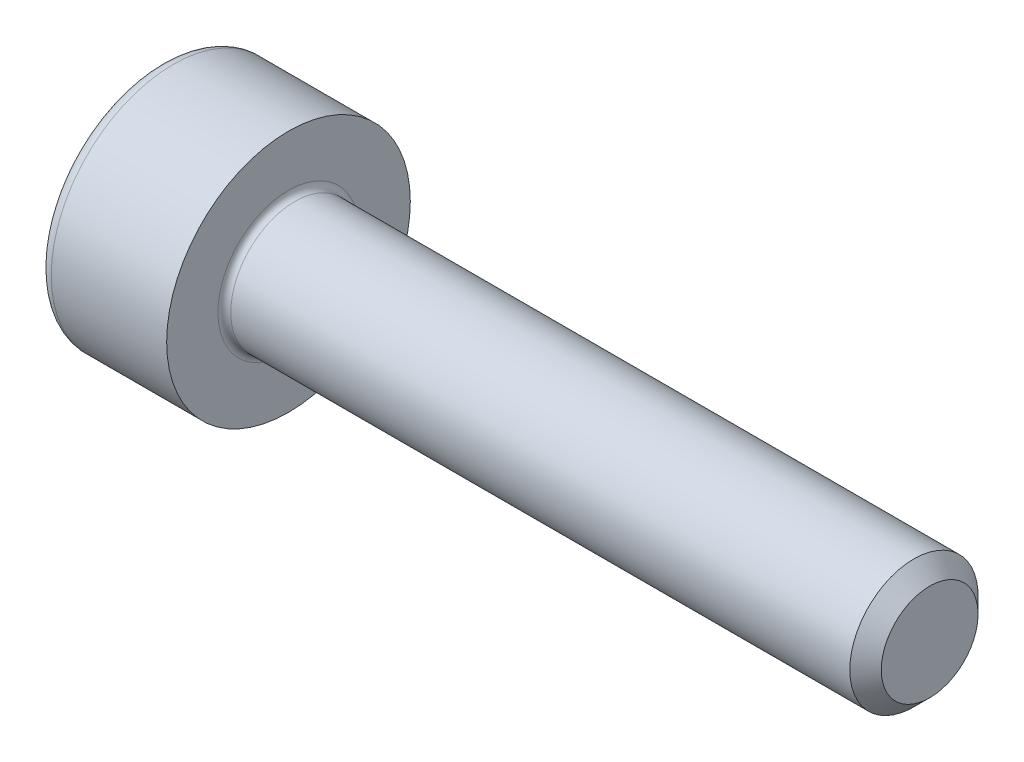
ISO-10303-21;
HEADER;
FILE_DESCRIPTION(('STEP AP214'),'2;1');
FILE_NAME('part.step','',(''),(''),'','','');
FILE_SCHEMA(('AUTOMOTIVE_DESIGN { 1 0 10303 214 1 1 1 1 }'));
ENDSEC;
DATA;
#1=APPLICATION_CONTEXT('core data for automotive mechanical design processes');
#2=APPLICATION_PROTOCOL_DEFINITION('international standard','automotive_design',2000,#1);
#3=PRODUCT_CONTEXT('',#1,'mechanical');
#4=PRODUCT('Part','Part','',(#3));
#5=PRODUCT_RELATED_PRODUCT_CATEGORY('part','',(#4));
#6=PRODUCT_DEFINITION_FORMATION('','',#4);
#7=PRODUCT_DEFINITION_CONTEXT('part definition',#1,'design');
#8=PRODUCT_DEFINITION('design','',#6,#7);
#9=PRODUCT_DEFINITION_SHAPE('','',#8);
#10=(LENGTH_UNIT() NAMED_UNIT(*) SI_UNIT(.MILLI.,.METRE.));
#11=(NAMED_UNIT(*) PLANE_ANGLE_UNIT() SI_UNIT($,.RADIAN.));
#12=(NAMED_UNIT(*) SI_UNIT($,.STERADIAN.) SOLID_ANGLE_UNIT());
#13=UNCERTAINTY_MEASURE_WITH_UNIT(LENGTH_MEASURE(1.E-05),#10,'distance_accuracy_value','');
#14=(GEOMETRIC_REPRESENTATION_CONTEXT(3) GLOBAL_UNCERTAINTY_ASSIGNED_CONTEXT((#13)) GLOBAL_UNIT_ASSIGNED_CONTEXT((#10,
#11,#12)) REPRESENTATION_CONTEXT('',''));
#15=CARTESIAN_POINT('',(0.,0.,0.));
#16=DIRECTION('',(0.,0.,1.));
#17=DIRECTION('',(1.,0.,0.));
#18=AXIS2_PLACEMENT_3D('',#15,#16,#17);
#19=CARTESIAN_POINT('',(-1.00299999991194,0.,0.));
#20=DIRECTION('',(-1.,0.,0.));
#21=DIRECTION('',(0.,0.,1.));
#22=AXIS2_PLACEMENT_3D('',#19,#20,#21);
#23=CONICAL_SURFACE('',#22,0.87122155605357,1.04719755097502);
#24=CARTESIAN_POINT('',(-0.499999999931333,-1.13686837721616E-10,0.));
#25=VERTEX_POINT('',#24);
#26=VERTEX_LOOP('',#25);
#27=FACE_BOUND('',#26,.T.);
#28=CARTESIAN_POINT('',(-0.999999999999139,0.750000000000001,0.433012701892466));
#29=CARTESIAN_POINT('',(-0.989010828274123,0.750000000000001,0.394956130482365));
#30=CARTESIAN_POINT('',(-0.979016752655061,0.750000000000001,0.356571055064928));
#31=CARTESIAN_POINT('',(-0.961572394475009,0.750000000000001,0.279136292172625));
#32=CARTESIAN_POINT('',(-0.954128282395011,0.750000000000001,0.240085229279367));
#33=CARTESIAN_POINT('',(-0.942540984774368,0.750000000000001,0.162467043896136));
#34=CARTESIAN_POINT('',(-0.938320670368358,0.750000000000001,0.123911860610086));
#35=CARTESIAN_POINT('',(-0.93328343795916,0.750000000000001,0.0466201737724062));
#36=CARTESIAN_POINT('',(-0.932462347691122,0.750000000000001,0.00788395096232354));
#37=CARTESIAN_POINT('',(-0.934174858786502,0.75,-0.0644905258223559));
#38=CARTESIAN_POINT('',(-0.936287981927561,0.75,-0.0981396401781204));
#39=CARTESIAN_POINT('',(-0.94298398773847,0.75,-0.165218655887636));
#40=CARTESIAN_POINT('',(-0.947569155512113,0.75,-0.198648325406153));
#41=CARTESIAN_POINT('',(-0.959031187483326,0.75,-0.265865530215778));
#42=CARTESIAN_POINT('',(-0.965956615816203,0.75,-0.29964456255408));
#43=CARTESIAN_POINT('',(-0.981674410305431,0.75,-0.366698958678095));
#44=CARTESIAN_POINT('',(-0.990463085776195,0.75,-0.399975180845456));
#45=CARTESIAN_POINT('',(-0.999999999999139,0.75,-0.433012701892468));
#46=B_SPLINE_CURVE_WITH_KNOTS('',3,(#28,#29,#30,#31,#32,#33,#34,#35,#36,#37,#38,#39,#40,#41,#42,
#43,#44,#45),.UNSPECIFIED.,.F.,.F.,(4,2,2,2,2,2,2,2,4),(0.,0.118881004375927,0.238047681474652,
0.35426535240403,0.470340333440371,0.57139041858436,0.672534072764113,0.77592060852025,
0.879104240150683),.UNSPECIFIED.);
#47=CARTESIAN_POINT('',(-0.999999999999139,0.750000000000108,0.43301270189228));
#48=VERTEX_POINT('',#47);
#49=CARTESIAN_POINT('',(-0.999999999999103,0.749999999999999,-0.433012701892344));
#50=VERTEX_POINT('',#49);
#51=EDGE_CURVE('E20',#48,#50,#46,.T.);
#52=ORIENTED_EDGE('',*,*,#51,.T.);
#53=CARTESIAN_POINT('',(-0.999999999999138,0.750000000000213,-0.433012701892096));
#54=CARTESIAN_POINT('',(-0.989010828274122,0.717042042378129,-0.452040987597147));
#55=CARTESIAN_POINT('',(-0.979016752655061,0.683799591940447,-0.471233525305865));
#56=CARTESIAN_POINT('',(-0.961572394475009,0.616739120139688,-0.509950906752017));
#57=CARTESIAN_POINT('',(-0.95412828239501,0.582919907629343,-0.529476438198646));
#58=CARTESIAN_POINT('',(-0.942540984774367,0.515700587291815,-0.568285530890261));
#59=CARTESIAN_POINT('',(-0.938320670368358,0.482310819118531,-0.587563122533286));
#60=CARTESIAN_POINT('',(-0.93328343795916,0.415374254815749,-0.626208965952126));
#61=CARTESIAN_POINT('',(-0.932462347691122,0.381827701815563,-0.645577077357167));
#62=CARTESIAN_POINT('',(-0.934174858786501,0.319149566334424,-0.681764315749507));
#63=CARTESIAN_POINT('',(-0.93628798192756,0.290008578487484,-0.698588872927389));
#64=CARTESIAN_POINT('',(-0.94298398773847,0.231916446822188,-0.732128380782147));
#65=CARTESIAN_POINT('',(-0.947569155512112,0.202965503779034,-0.748843215541406));
#66=CARTESIAN_POINT('',(-0.959031187483326,0.144753696842518,-0.782451817946218));
#67=CARTESIAN_POINT('',(-0.965956615816203,0.115500196722292,-0.799341334115369));
#68=CARTESIAN_POINT('',(-0.98167441030543,0.0574293862434705,-0.832868532177376));
#69=CARTESIAN_POINT('',(-0.990463085776194,0.028611332504561,-0.849506643261057));
#70=CARTESIAN_POINT('',(-0.999999999999139,-2.14938784748896E-13,-0.866025403784563));
#71=B_SPLINE_CURVE_WITH_KNOTS('',3,(#53,#54,#55,#56,#57,#58,#59,#60,#61,#62,#63,#64,#65,#66,#67,
#68,#69,#70),.UNSPECIFIED.,.F.,.F.,(4,2,2,2,2,2,2,2,4),(0.,0.118881004375927,0.238047681474651,
0.35426535240403,0.47034033344037,0.57139041858436,0.672534072764112,0.775920608520249,
0.879104240150682),.UNSPECIFIED.);
#72=CARTESIAN_POINT('',(-0.999999999999139,0.,-0.866025403784563));
#73=VERTEX_POINT('',#72);
#74=EDGE_CURVE('E81',#50,#73,#71,.T.);
#75=ORIENTED_EDGE('',*,*,#74,.T.);
#76=CARTESIAN_POINT('',(-0.999999999999139,2.14141842110255E-13,-0.866025403784563));
#77=CARTESIAN_POINT('',(-0.989010828274122,-0.0329579576218703,-0.846997118079512));
#78=CARTESIAN_POINT('',(-0.979016752655061,-0.0662004080595519,-0.827804580370794));
#79=CARTESIAN_POINT('',(-0.961572394475009,-0.133260879860311,-0.789087198924642));
#80=CARTESIAN_POINT('',(-0.95412828239501,-0.167080092370656,-0.769561667478013));
#81=CARTESIAN_POINT('',(-0.942540984774368,-0.234299412708184,-0.730752574786398));
#82=CARTESIAN_POINT('',(-0.938320670368358,-0.267689180881469,-0.711474983143373));
#83=CARTESIAN_POINT('',(-0.93328343795916,-0.334625745184251,-0.672829139724533));
#84=CARTESIAN_POINT('',(-0.932462347691122,-0.368172298184437,-0.653461028319491));
#85=CARTESIAN_POINT('',(-0.934174858786501,-0.430850433665576,-0.617273789927152));
#86=CARTESIAN_POINT('',(-0.93628798192756,-0.459991421512516,-0.600449232749269));
#87=CARTESIAN_POINT('',(-0.94298398773847,-0.518083553177812,-0.566909724894512));
#88=CARTESIAN_POINT('',(-0.947569155512112,-0.547034496220966,-0.550194890135253));
#89=CARTESIAN_POINT('',(-0.959031187483326,-0.605246303157482,-0.516586287730441));
#90=CARTESIAN_POINT('',(-0.965956615816203,-0.634499803277708,-0.499696771561289));
#91=CARTESIAN_POINT('',(-0.981674410305431,-0.69257061375653,-0.466169573499282));
#92=CARTESIAN_POINT('',(-0.990463085776195,-0.721388667495439,-0.449531462415602));
#93=CARTESIAN_POINT('',(-0.999999999999139,-0.750000000000215,-0.433012701892095));
#94=B_SPLINE_CURVE_WITH_KNOTS('',3,(#76,#77,#78,#79,#80,#81,#82,#83,#84,#85,#86,#87,#88,#89,#90,
#91,#92,#93),.UNSPECIFIED.,.F.,.F.,(4,2,2,2,2,2,2,2,4),(0.,0.118881004375927,0.238047681474651,
0.35426535240403,0.470340333440371,0.57139041858436,0.672534072764113,0.77592060852025,
0.879104240150683),.UNSPECIFIED.);
#95=CARTESIAN_POINT('',(-0.999999999999139,-0.750000000000108,-0.433012701892281));
#96=VERTEX_POINT('',#95);
#97=EDGE_CURVE('E113',#73,#96,#94,.T.);
#98=ORIENTED_EDGE('',*,*,#97,.T.);
#99=CARTESIAN_POINT('',(-0.999999999999138,-0.75,-0.433012701892467));
#100=CARTESIAN_POINT('',(-0.989010828274122,-0.75,-0.394956130482365));
#101=CARTESIAN_POINT('',(-0.979016752655061,-0.75,-0.356571055064929));
#102=CARTESIAN_POINT('',(-0.961572394475009,-0.75,-0.279136292172626));
#103=CARTESIAN_POINT('',(-0.95412828239501,-0.75,-0.240085229279368));
#104=CARTESIAN_POINT('',(-0.942540984774367,-0.75,-0.162467043896137));
#105=CARTESIAN_POINT('',(-0.938320670368358,-0.75,-0.123911860610087));
#106=CARTESIAN_POINT('',(-0.93328343795916,-0.75,-0.0466201737724072));
#107=CARTESIAN_POINT('',(-0.932462347691122,-0.75,-0.00788395096232463));
#108=CARTESIAN_POINT('',(-0.934174858786501,-0.75,0.0644905258223548));
#109=CARTESIAN_POINT('',(-0.93628798192756,-0.75,0.0981396401781195));
#110=CARTESIAN_POINT('',(-0.942983987738469,-0.75,0.165218655887635));
#111=CARTESIAN_POINT('',(-0.947569155512112,-0.75,0.198648325406152));
#112=CARTESIAN_POINT('',(-0.959031187483326,-0.75,0.265865530215777));
#113=CARTESIAN_POINT('',(-0.965956615816203,-0.75,0.29964456255408));
#114=CARTESIAN_POINT('',(-0.98167441030543,-0.75,0.366698958678094));
#115=CARTESIAN_POINT('',(-0.990463085776194,-0.75,0.399975180845455));
#116=CARTESIAN_POINT('',(-0.999999999999139,-0.75,0.433012701892468));
#117=B_SPLINE_CURVE_WITH_KNOTS('',3,(#99,#100,#101,#102,#103,#104,#105,#106,#107,#108,#109,#110,
#111,#112,#113,#114,#115,#116),.UNSPECIFIED.,.F.,.F.,(4,2,2,2,2,2,2,2,4),(0.,0.118881004375927,
0.238047681474651,0.35426535240403,0.47034033344037,0.57139041858436,0.672534072764113,
0.77592060852025,0.879104240150683),.UNSPECIFIED.);
#118=CARTESIAN_POINT('',(-0.999999999999139,-0.750000000000107,0.433012701892282));
#119=VERTEX_POINT('',#118);
#120=EDGE_CURVE('E137',#96,#119,#117,.T.);
#121=ORIENTED_EDGE('',*,*,#120,.T.);
#122=CARTESIAN_POINT('',(-0.999999999999139,-0.750000000000214,0.433012701892096));
#123=CARTESIAN_POINT('',(-0.989010828274122,-0.71704204237813,0.452040987597147));
#124=CARTESIAN_POINT('',(-0.979016752655061,-0.683799591940448,0.471233525305865));
#125=CARTESIAN_POINT('',(-0.961572394475009,-0.616739120139689,0.509950906752017));
#126=CARTESIAN_POINT('',(-0.95412828239501,-0.582919907629344,0.529476438198646));
#127=CARTESIAN_POINT('',(-0.942540984774368,-0.515700587291816,0.568285530890261));
#128=CARTESIAN_POINT('',(-0.938320670368358,-0.482310819118532,0.587563122533286));
#129=CARTESIAN_POINT('',(-0.93328343795916,-0.415374254815749,0.626208965952126));
#130=CARTESIAN_POINT('',(-0.932462347691122,-0.381827701815564,0.645577077357168));
#131=CARTESIAN_POINT('',(-0.934174858786502,-0.319149566334424,0.681764315749507));
#132=CARTESIAN_POINT('',(-0.936287981927561,-0.290008578487484,0.698588872927389));
#133=CARTESIAN_POINT('',(-0.94298398773847,-0.231916446822189,0.732128380782147));
#134=CARTESIAN_POINT('',(-0.947569155512113,-0.202965503779035,0.748843215541406));
#135=CARTESIAN_POINT('',(-0.959031187483326,-0.144753696842518,0.782451817946218));
#136=CARTESIAN_POINT('',(-0.965956615816204,-0.115500196722292,0.799341334115369));
#137=CARTESIAN_POINT('',(-0.981674410305431,-0.0574293862434712,0.832868532177376));
#138=CARTESIAN_POINT('',(-0.990463085776195,-0.0286113325045617,0.849506643261057));
#139=CARTESIAN_POINT('',(-0.999999999999139,2.14377914831157E-13,0.866025403784563));
#140=B_SPLINE_CURVE_WITH_KNOTS('',3,(#122,#123,#124,#125,#126,#127,#128,#129,#130,#131,#132,
#133,#134,#135,#136,#137,#138,#139),.UNSPECIFIED.,.F.,.F.,(4,2,2,2,2,2,2,2,4),(0.,
0.118881004375927,0.238047681474651,0.35426535240403,0.47034033344037,0.57139041858436,
0.672534072764112,0.775920608520249,0.879104240150682),.UNSPECIFIED.);
#141=CARTESIAN_POINT('',(-0.999999999999139,0.,0.866025403784563));
#142=VERTEX_POINT('',#141);
#143=EDGE_CURVE('E146',#119,#142,#140,.T.);
#144=ORIENTED_EDGE('',*,*,#143,.T.);
#145=CARTESIAN_POINT('',(-0.999999999999139,-2.14584124643291E-13,0.866025403784563));
#146=CARTESIAN_POINT('',(-0.989010828274122,0.03295795762187,0.846997118079512));
#147=CARTESIAN_POINT('',(-0.979016752655061,0.0662004080595515,0.827804580370794));
#148=CARTESIAN_POINT('',(-0.961572394475009,0.133260879860311,0.789087198924642));
#149=CARTESIAN_POINT('',(-0.95412828239501,0.167080092370656,0.769561667478013));
#150=CARTESIAN_POINT('',(-0.942540984774368,0.234299412708184,0.730752574786398));
#151=CARTESIAN_POINT('',(-0.938320670368358,0.267689180881468,0.711474983143373));
#152=CARTESIAN_POINT('',(-0.93328343795916,0.33462574518425,0.672829139724533));
#153=CARTESIAN_POINT('',(-0.932462347691122,0.368172298184436,0.653461028319491));
#154=CARTESIAN_POINT('',(-0.934174858786501,0.430850433665575,0.617273789927151));
#155=CARTESIAN_POINT('',(-0.93628798192756,0.459991421512515,0.600449232749269));
#156=CARTESIAN_POINT('',(-0.942983987738469,0.518083553177811,0.566909724894511));
#157=CARTESIAN_POINT('',(-0.947569155512112,0.547034496220965,0.550194890135252));
#158=CARTESIAN_POINT('',(-0.959031187483325,0.605246303157482,0.51658628773044));
#159=CARTESIAN_POINT('',(-0.965956615816203,0.634499803277708,0.499696771561289));
#160=CARTESIAN_POINT('',(-0.98167441030543,0.692570613756529,0.466169573499282));
#161=CARTESIAN_POINT('',(-0.990463085776194,0.721388667495439,0.449531462415601));
#162=CARTESIAN_POINT('',(-0.999999999999139,0.750000000000215,0.433012701892094));
#163=B_SPLINE_CURVE_WITH_KNOTS('',3,(#145,#146,#147,#148,#149,#150,#151,#152,#153,#154,#155,
#156,#157,#158,#159,#160,#161,#162),.UNSPECIFIED.,.F.,.F.,(4,2,2,2,2,2,2,2,4),(0.,
0.118881004375927,0.238047681474652,0.35426535240403,0.470340333440371,0.571390418584361,
0.672534072764113,0.77592060852025,0.879104240150684),.UNSPECIFIED.);
#164=EDGE_CURVE('E83',#142,#48,#163,.T.);
#165=ORIENTED_EDGE('',*,*,#164,.T.);
#166=EDGE_LOOP('',(#52,#75,#98,#121,#144,#165));
#167=FACE_BOUND('',#166,.T.);
#168=ADVANCED_FACE('F16',(#27,#167),#23,.F.);
#169=CARTESIAN_POINT('',(-2.,0.750000000000001,0.433012701892219));
#170=DIRECTION('',(0.,1.,0.));
#171=DIRECTION('',(0.,0.,1.));
#172=AXIS2_PLACEMENT_3D('',#169,#170,#171);
#173=PLANE('',#172);
#174=DIRECTION('',(1.,0.,0.));
#175=VECTOR('',#174,1.);
#176=CARTESIAN_POINT('',(-2.,0.75,0.433012701892218));
#177=LINE('',#176,#175);
#178=CARTESIAN_POINT('',(-2.,0.75,0.433012701892219));
#179=VERTEX_POINT('',#178);
#180=EDGE_CURVE('E86',#48,#179,#177,.F.);
#181=ORIENTED_EDGE('',*,*,#180,.T.);
#182=DIRECTION('',(0.,0.,1.));
#183=VECTOR('',#182,1.);
#184=CARTESIAN_POINT('',(-2.,0.749999999999999,0.));
#185=LINE('',#184,#183);
#186=CARTESIAN_POINT('',(-2.,0.749999999999999,-0.43301270189222));
#187=VERTEX_POINT('',#186);
#188=EDGE_CURVE('E91',#187,#179,#185,.T.);
#189=ORIENTED_EDGE('',*,*,#188,.F.);
#190=DIRECTION('',(1.,0.,0.));
#191=VECTOR('',#190,1.);
#192=CARTESIAN_POINT('',(-2.,0.749999999999999,-0.43301270189222));
#193=LINE('',#192,#191);
#194=EDGE_CURVE('E89',#187,#50,#193,.T.);
#195=ORIENTED_EDGE('',*,*,#194,.T.);
#196=ORIENTED_EDGE('',*,*,#51,.F.);
#197=EDGE_LOOP('',(#181,#189,#195,#196));
#198=FACE_BOUND('',#197,.T.);
#199=ADVANCED_FACE('F77',(#198),#173,.F.);
#200=CARTESIAN_POINT('',(-2.,0.,0.866025403784439));
#201=DIRECTION('',(0.,0.500000000000001,0.866025403784438));
#202=DIRECTION('',(0.,-0.866025403784438,0.500000000000001));
#203=AXIS2_PLACEMENT_3D('',#200,#201,#202);
#204=PLANE('',#203);
#205=DIRECTION('',(1.,0.,0.));
#206=VECTOR('',#205,1.);
#207=CARTESIAN_POINT('',(-2.,0.,0.866025403784439));
#208=LINE('',#207,#206);
#209=CARTESIAN_POINT('',(-2.,0.,0.866025403784439));
#210=VERTEX_POINT('',#209);
#211=EDGE_CURVE('E151',#142,#210,#208,.F.);
#212=ORIENTED_EDGE('',*,*,#211,.T.);
#213=DIRECTION('',(0.,-0.866025403784438,0.5));
#214=VECTOR('',#213,1.);
#215=CARTESIAN_POINT('',(-2.,0.750000000000001,0.433012701892219));
#216=LINE('',#215,#214);
#217=EDGE_CURVE('E103',#179,#210,#216,.T.);
#218=ORIENTED_EDGE('',*,*,#217,.F.);
#219=ORIENTED_EDGE('',*,*,#180,.F.);
#220=ORIENTED_EDGE('',*,*,#164,.F.);
#221=EDGE_LOOP('',(#212,#218,#219,#220));
#222=FACE_BOUND('',#221,.T.);
#223=ADVANCED_FACE('F156',(#222),#204,.F.);
#224=CARTESIAN_POINT('',(-2.,-0.75,0.43301270189222));
#225=DIRECTION('',(0.,-0.5,0.866025403784439));
#226=DIRECTION('',(0.,-0.866025403784439,-0.5));
#227=AXIS2_PLACEMENT_3D('',#224,#225,#226);
#228=PLANE('',#227);
#229=DIRECTION('',(1.,0.,0.));
#230=VECTOR('',#229,1.);
#231=CARTESIAN_POINT('',(-2.,-0.75,0.43301270189222));
#232=LINE('',#231,#230);
#233=CARTESIAN_POINT('',(-2.,-0.75,0.43301270189222));
#234=VERTEX_POINT('',#233);
#235=EDGE_CURVE('E145',#119,#234,#232,.F.);
#236=ORIENTED_EDGE('',*,*,#235,.T.);
#237=DIRECTION('',(0.,-0.866025403784439,-0.5));
#238=VECTOR('',#237,1.);
#239=CARTESIAN_POINT('',(-2.,0.,0.866025403784439));
#240=LINE('',#239,#238);
#241=EDGE_CURVE('E282',#210,#234,#240,.T.);
#242=ORIENTED_EDGE('',*,*,#241,.F.);
#243=ORIENTED_EDGE('',*,*,#211,.F.);
#244=ORIENTED_EDGE('',*,*,#143,.F.);
#245=EDGE_LOOP('',(#236,#242,#243,#244));
#246=FACE_BOUND('',#245,.T.);
#247=ADVANCED_FACE('F133',(#246),#228,.F.);
#248=CARTESIAN_POINT('',(-2.,-0.75,-0.433012701892219));
#249=DIRECTION('',(0.,-1.,0.));
#250=DIRECTION('',(1.,0.,0.));
#251=AXIS2_PLACEMENT_3D('',#248,#249,#250);
#252=PLANE('',#251);
#253=DIRECTION('',(1.,0.,0.));
#254=VECTOR('',#253,1.);
#255=CARTESIAN_POINT('',(-2.,-0.750000000000001,-0.433012701892219));
#256=LINE('',#255,#254);
#257=CARTESIAN_POINT('',(-2.,-0.75,-0.433012701892219));
#258=VERTEX_POINT('',#257);
#259=EDGE_CURVE('E144',#96,#258,#256,.F.);
#260=ORIENTED_EDGE('',*,*,#259,.T.);
#261=DIRECTION('',(0.,0.,1.));
#262=VECTOR('',#261,1.);
#263=CARTESIAN_POINT('',(-2.,-0.75,0.));
#264=LINE('',#263,#262);
#265=EDGE_CURVE('E276',#234,#258,#264,.F.);
#266=ORIENTED_EDGE('',*,*,#265,.F.);
#267=ORIENTED_EDGE('',*,*,#235,.F.);
#268=ORIENTED_EDGE('',*,*,#120,.F.);
#269=EDGE_LOOP('',(#260,#266,#267,#268));
#270=FACE_BOUND('',#269,.T.);
#271=ADVANCED_FACE('F129',(#270),#252,.F.);
#272=CARTESIAN_POINT('',(-2.,0.,-0.866025403784439));
#273=DIRECTION('',(0.,-0.5,-0.866025403784438));
#274=DIRECTION('',(0.,0.866025403784438,-0.5));
#275=AXIS2_PLACEMENT_3D('',#272,#273,#274);
#276=PLANE('',#275);
#277=DIRECTION('',(1.,0.,0.));
#278=VECTOR('',#277,1.);
#279=CARTESIAN_POINT('',(-2.,0.,-0.866025403784439));
#280=LINE('',#279,#278);
#281=CARTESIAN_POINT('',(-2.,0.,-0.866025403784439));
#282=VERTEX_POINT('',#281);
#283=EDGE_CURVE('E39',#73,#282,#280,.F.);
#284=ORIENTED_EDGE('',*,*,#283,.T.);
#285=DIRECTION('',(0.,0.866025403784438,-0.500000000000001));
#286=VECTOR('',#285,1.);
#287=CARTESIAN_POINT('',(-2.,-0.75,-0.433012701892219));
#288=LINE('',#287,#286);
#289=EDGE_CURVE('E270',#258,#282,#288,.T.);
#290=ORIENTED_EDGE('',*,*,#289,.F.);
#291=ORIENTED_EDGE('',*,*,#259,.F.);
#292=ORIENTED_EDGE('',*,*,#97,.F.);
#293=EDGE_LOOP('',(#284,#290,#291,#292));
#294=FACE_BOUND('',#293,.T.);
#295=ADVANCED_FACE('F123',(#294),#276,.F.);
#296=CARTESIAN_POINT('',(-2.,0.749999999999999,-0.43301270189222));
#297=DIRECTION('',(0.,0.5,-0.866025403784439));
#298=DIRECTION('',(0.,0.866025403784439,0.5));
#299=AXIS2_PLACEMENT_3D('',#296,#297,#298);
#300=PLANE('',#299);
#301=ORIENTED_EDGE('',*,*,#194,.F.);
#302=DIRECTION('',(0.,0.866025403784438,0.5));
#303=VECTOR('',#302,1.);
#304=CARTESIAN_POINT('',(-2.,0.,-0.866025403784439));
#305=LINE('',#304,#303);
#306=EDGE_CURVE('E267',#282,#187,#305,.T.);
#307=ORIENTED_EDGE('',*,*,#306,.F.);
#308=ORIENTED_EDGE('',*,*,#283,.F.);
#309=ORIENTED_EDGE('',*,*,#74,.F.);
#310=EDGE_LOOP('',(#301,#307,#308,#309));
#311=FACE_BOUND('',#310,.T.);
#312=ADVANCED_FACE('F96',(#311),#300,.F.);
#313=CARTESIAN_POINT('',(-2.,1.38301270189222,0.));
#314=DIRECTION('',(-1.,0.,0.));
#315=DIRECTION('',(0.,-1.,0.));
#316=AXIS2_PLACEMENT_3D('',#313,#314,#315);
#317=PLANE('',#316);
#318=ORIENTED_EDGE('',*,*,#289,.T.);
#319=ORIENTED_EDGE('',*,*,#306,.T.);
#320=ORIENTED_EDGE('',*,*,#188,.T.);
#321=ORIENTED_EDGE('',*,*,#217,.T.);
#322=ORIENTED_EDGE('',*,*,#241,.T.);
#323=ORIENTED_EDGE('',*,*,#265,.T.);
#324=EDGE_LOOP('',(#318,#319,#320,#321,#322,#323));
#325=FACE_BOUND('',#324,.T.);
#326=CARTESIAN_POINT('',(-2.,0.,0.));
#327=DIRECTION('',(1.,0.,0.));
#328=DIRECTION('',(0.,1.,0.));
#329=AXIS2_PLACEMENT_3D('',#326,#327,#328);
#330=CIRCLE('',#329,1.7);
#331=CARTESIAN_POINT('',(-2.,1.7,0.));
#332=VERTEX_POINT('',#331);
#333=EDGE_CURVE('E226',#332,#332,#330,.T.);
#334=ORIENTED_EDGE('',*,*,#333,.F.);
#335=EDGE_LOOP('',(#334));
#336=FACE_BOUND('',#335,.T.);
#337=ADVANCED_FACE('F122',(#325,#336),#317,.T.);
#338=CARTESIAN_POINT('',(-1.8,0.,0.));
#339=DIRECTION('',(1.,0.,0.));
#340=DIRECTION('',(0.,0.,-1.));
#341=AXIS2_PLACEMENT_3D('',#338,#339,#340);
#342=TOROIDAL_SURFACE('',#341,1.7,0.2);
#343=CARTESIAN_POINT('',(-1.8,0.,0.));
#344=DIRECTION('',(1.,0.,0.));
#345=DIRECTION('',(0.,1.,0.));
#346=AXIS2_PLACEMENT_3D('',#343,#344,#345);
#347=CIRCLE('',#346,1.9);
#348=CARTESIAN_POINT('',(-1.8,1.9,0.));
#349=VERTEX_POINT('',#348);
#350=EDGE_CURVE('E302',#349,#349,#347,.T.);
#351=ORIENTED_EDGE('',*,*,#350,.F.);
#352=EDGE_LOOP('',(#351));
#353=FACE_BOUND('',#352,.T.);
#354=ORIENTED_EDGE('',*,*,#333,.T.);
#355=EDGE_LOOP('',(#354));
#356=FACE_BOUND('',#355,.T.);
#357=ADVANCED_FACE('F210',(#353,#356),#342,.T.);
#358=CARTESIAN_POINT('',(-0.999999999999996,0.,0.));
#359=DIRECTION('',(1.,0.,0.));
#360=DIRECTION('',(0.,1.,0.));
#361=AXIS2_PLACEMENT_3D('',#358,#359,#360);
#362=CYLINDRICAL_SURFACE('',#361,1.9);
#363=ORIENTED_EDGE('',*,*,#350,.T.);
#364=EDGE_LOOP('',(#363));
#365=FACE_BOUND('',#364,.T.);
#366=CARTESIAN_POINT('',(0.,0.,0.));
#367=DIRECTION('',(1.,0.,0.));
#368=DIRECTION('',(0.,1.,0.));
#369=AXIS2_PLACEMENT_3D('',#366,#367,#368);
#370=CIRCLE('',#369,1.9);
#371=CARTESIAN_POINT('',(0.,1.9,0.));
#372=VERTEX_POINT('',#371);
#373=EDGE_CURVE('E111',#372,#372,#370,.T.);
#374=ORIENTED_EDGE('',*,*,#373,.F.);
#375=EDGE_LOOP('',(#374));
#376=FACE_BOUND('',#375,.T.);
#377=ADVANCED_FACE('F207',(#365,#376),#362,.T.);
#378=CARTESIAN_POINT('',(10.,0.499999999999999,0.));
#379=DIRECTION('',(1.,0.,0.));
#380=DIRECTION('',(0.,1.,0.));
#381=AXIS2_PLACEMENT_3D('',#378,#379,#380);
#382=PLANE('',#381);
#383=CARTESIAN_POINT('',(9.99999999999091,0.,0.));
#384=DIRECTION('',(-1.,0.,0.));
#385=DIRECTION('',(0.,0.,1.));
#386=AXIS2_PLACEMENT_3D('',#383,#384,#385);
#387=CIRCLE('',#386,0.754619999952411);
#388=CARTESIAN_POINT('',(9.99999999999091,0.,0.754619999952411));
#389=VERTEX_POINT('',#388);
#390=EDGE_CURVE('E294',#389,#389,#387,.T.);
#391=ORIENTED_EDGE('',*,*,#390,.F.);
#392=EDGE_LOOP('',(#391));
#393=FACE_BOUND('',#392,.T.);
#394=ADVANCED_FACE('F204',(#393),#382,.T.);
#395=CARTESIAN_POINT('',(0.,1.45,0.));
#396=DIRECTION('',(1.,0.,0.));
#397=DIRECTION('',(0.,1.,0.));
#398=AXIS2_PLACEMENT_3D('',#395,#396,#397);
#399=PLANE('',#398);
#400=CARTESIAN_POINT('',(0.,0.,0.));
#401=DIRECTION('',(1.,0.,0.));
#402=DIRECTION('',(0.,1.,0.));
#403=AXIS2_PLACEMENT_3D('',#400,#401,#402);
#404=CIRCLE('',#403,1.1);
#405=CARTESIAN_POINT('',(0.,1.1,0.));
#406=VERTEX_POINT('',#405);
#407=EDGE_CURVE('E191',#406,#406,#404,.F.);
#408=ORIENTED_EDGE('',*,*,#407,.T.);
#409=EDGE_LOOP('',(#408));
#410=FACE_BOUND('',#409,.T.);
#411=ORIENTED_EDGE('',*,*,#373,.T.);
#412=EDGE_LOOP('',(#411));
#413=FACE_BOUND('',#412,.T.);
#414=ADVANCED_FACE('F195',(#410,#413),#399,.T.);
#415=CARTESIAN_POINT('',(9.75462000002381,0.,0.));
#416=DIRECTION('',(-1.,0.,0.));
#417=DIRECTION('',(0.,0.,1.));
#418=AXIS2_PLACEMENT_3D('',#415,#416,#417);
#419=CONICAL_SURFACE('',#418,0.99999999991951,0.785398163397448);
#420=ORIENTED_EDGE('',*,*,#390,.T.);
#421=EDGE_LOOP('',(#420));
#422=FACE_BOUND('',#421,.T.);
#423=CARTESIAN_POINT('',(9.75462,0.,0.));
#424=DIRECTION('',(1.,0.,0.));
#425=DIRECTION('',(0.,1.,0.));
#426=AXIS2_PLACEMENT_3D('',#423,#424,#425);
#427=CIRCLE('',#426,0.999999999999998);
#428=CARTESIAN_POINT('',(9.75462,0.999999999999998,0.));
#429=VERTEX_POINT('',#428);
#430=EDGE_CURVE('E30',#429,#429,#427,.F.);
#431=ORIENTED_EDGE('',*,*,#430,.F.);
#432=EDGE_LOOP('',(#431));
#433=FACE_BOUND('',#432,.T.);
#434=ADVANCED_FACE('F173',(#422,#433),#419,.T.);
#435=CARTESIAN_POINT('',(0.100000000000002,0.,0.));
#436=DIRECTION('',(1.,0.,0.));
#437=DIRECTION('',(0.,0.,-1.));
#438=AXIS2_PLACEMENT_3D('',#435,#436,#437);
#439=TOROIDAL_SURFACE('',#438,1.1,0.1);
#440=CARTESIAN_POINT('',(0.100000000000002,0.,0.));
#441=DIRECTION('',(1.,0.,0.));
#442=DIRECTION('',(0.,1.,0.));
#443=AXIS2_PLACEMENT_3D('',#440,#441,#442);
#444=CIRCLE('',#443,0.999999999999998);
#445=CARTESIAN_POINT('',(0.100000000000002,0.999999999999998,0.));
#446=VERTEX_POINT('',#445);
#447=EDGE_CURVE('E11',#446,#446,#444,.T.);
#448=ORIENTED_EDGE('',*,*,#447,.F.);
#449=EDGE_LOOP('',(#448));
#450=FACE_BOUND('',#449,.T.);
#451=ORIENTED_EDGE('',*,*,#407,.F.);
#452=EDGE_LOOP('',(#451));
#453=FACE_BOUND('',#452,.T.);
#454=ADVANCED_FACE('F167',(#450,#453),#439,.F.);
#455=CARTESIAN_POINT('',(5.52269,0.,0.));
#456=DIRECTION('',(1.,0.,0.));
#457=DIRECTION('',(0.,1.,0.));
#458=AXIS2_PLACEMENT_3D('',#455,#456,#457);
#459=CYLINDRICAL_SURFACE('',#458,0.999999999999998);
#460=ORIENTED_EDGE('',*,*,#447,.T.);
#461=EDGE_LOOP('',(#460));
#462=FACE_BOUND('',#461,.T.);
#463=ORIENTED_EDGE('',*,*,#430,.T.);
#464=EDGE_LOOP('',(#463));
#465=FACE_BOUND('',#464,.T.);
#466=ADVANCED_FACE('F165',(#462,#465),#459,.T.);
#467=CLOSED_SHELL('',(#168,#199,#223,#247,#271,#295,#312,#337,#357,#377,#394,#414,#434,#454,#466));
#468=MANIFOLD_SOLID_BREP('B1',#467);
#469=ADVANCED_BREP_SHAPE_REPRESENTATION('',(#18,#468),#14);
#470=SHAPE_DEFINITION_REPRESENTATION(#9,#469);
ENDSEC;
END-ISO-10303-21;
